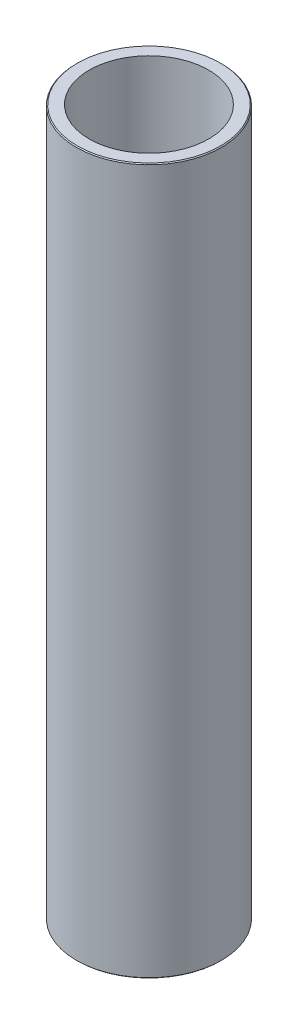
ISO-10303-21;
HEADER;
FILE_DESCRIPTION(('STEP AP214'),'2;1');
FILE_NAME('part.step','',(''),(''),'','','');
FILE_SCHEMA(('AUTOMOTIVE_DESIGN { 1 0 10303 214 1 1 1 1 }'));
ENDSEC;
DATA;
#1=APPLICATION_CONTEXT('core data for automotive mechanical design processes');
#2=APPLICATION_PROTOCOL_DEFINITION('international standard','automotive_design',2000,#1);
#3=PRODUCT_CONTEXT('',#1,'mechanical');
#4=PRODUCT('Part','Part','',(#3));
#5=PRODUCT_RELATED_PRODUCT_CATEGORY('part','',(#4));
#6=PRODUCT_DEFINITION_FORMATION('','',#4);
#7=PRODUCT_DEFINITION_CONTEXT('part definition',#1,'design');
#8=PRODUCT_DEFINITION('design','',#6,#7);
#9=PRODUCT_DEFINITION_SHAPE('','',#8);
#10=(LENGTH_UNIT() NAMED_UNIT(*) SI_UNIT(.MILLI.,.METRE.));
#11=(NAMED_UNIT(*) PLANE_ANGLE_UNIT() SI_UNIT($,.RADIAN.));
#12=(NAMED_UNIT(*) SI_UNIT($,.STERADIAN.) SOLID_ANGLE_UNIT());
#13=UNCERTAINTY_MEASURE_WITH_UNIT(LENGTH_MEASURE(1.E-05),#10,'distance_accuracy_value','');
#14=(GEOMETRIC_REPRESENTATION_CONTEXT(3) GLOBAL_UNCERTAINTY_ASSIGNED_CONTEXT((#13)) GLOBAL_UNIT_ASSIGNED_CONTEXT((#10,
#11,#12)) REPRESENTATION_CONTEXT('',''));
#15=CARTESIAN_POINT('',(0.,0.,0.));
#16=DIRECTION('',(0.,0.,1.));
#17=DIRECTION('',(1.,0.,0.));
#18=AXIS2_PLACEMENT_3D('',#15,#16,#17);
#19=CARTESIAN_POINT('',(0.,559.195337416163,0.));
#20=DIRECTION('',(0.,-1.,0.));
#21=DIRECTION('',(0.,0.,-1.));
#22=AXIS2_PLACEMENT_3D('',#19,#20,#21);
#23=CYLINDRICAL_SURFACE('',#22,57.5);
#24=CARTESIAN_POINT('',(0.,558.473531604233,0.));
#25=DIRECTION('',(0.,1.,0.));
#26=DIRECTION('',(0.,0.,1.));
#27=AXIS2_PLACEMENT_3D('',#24,#25,#26);
#28=CIRCLE('',#27,57.5);
#29=CARTESIAN_POINT('',(0.,558.473531604233,57.5));
#30=VERTEX_POINT('',#29);
#31=EDGE_CURVE('E50',#30,#30,#28,.F.);
#32=ORIENTED_EDGE('',*,*,#31,.T.);
#33=EDGE_LOOP('',(#32));
#34=FACE_BOUND('',#33,.T.);
#35=CARTESIAN_POINT('',(0.,0.721805811929932,0.));
#36=DIRECTION('',(0.,1.,0.));
#37=DIRECTION('',(0.,0.,1.));
#38=AXIS2_PLACEMENT_3D('',#35,#36,#37);
#39=CIRCLE('',#38,57.5);
#40=CARTESIAN_POINT('',(0.,0.721805811929932,57.5));
#41=VERTEX_POINT('',#40);
#42=EDGE_CURVE('E51',#41,#41,#39,.T.);
#43=ORIENTED_EDGE('',*,*,#42,.T.);
#44=EDGE_LOOP('',(#43));
#45=FACE_BOUND('',#44,.T.);
#46=ADVANCED_FACE('F39',(#34,#45),#23,.T.);
#47=CARTESIAN_POINT('',(0.,559.195337416163,0.));
#48=DIRECTION('',(0.,1.,0.));
#49=DIRECTION('',(0.,0.,1.));
#50=AXIS2_PLACEMENT_3D('',#47,#48,#49);
#51=PLANE('',#50);
#52=CARTESIAN_POINT('',(0.,559.195337416163,0.));
#53=DIRECTION('',(0.,1.,0.));
#54=DIRECTION('',(0.,0.,1.));
#55=AXIS2_PLACEMENT_3D('',#52,#53,#54);
#56=CIRCLE('',#55,56.7781941880701);
#57=CARTESIAN_POINT('',(0.,559.195337416163,56.7781941880701));
#58=VERTEX_POINT('',#57);
#59=EDGE_CURVE('E54',#58,#58,#56,.T.);
#60=ORIENTED_EDGE('',*,*,#59,.T.);
#61=EDGE_LOOP('',(#60));
#62=FACE_BOUND('',#61,.T.);
#63=CARTESIAN_POINT('',(0.,559.195337416163,0.));
#64=DIRECTION('',(0.,1.,0.));
#65=DIRECTION('',(0.,0.,1.));
#66=AXIS2_PLACEMENT_3D('',#63,#64,#65);
#67=CIRCLE('',#66,47.3325763658902);
#68=CARTESIAN_POINT('',(0.,559.195337416163,47.3325763658902));
#69=VERTEX_POINT('',#68);
#70=EDGE_CURVE('E58',#69,#69,#67,.T.);
#71=ORIENTED_EDGE('',*,*,#70,.F.);
#72=EDGE_LOOP('',(#71));
#73=FACE_BOUND('',#72,.T.);
#74=ADVANCED_FACE('F69',(#62,#73),#51,.T.);
#75=CARTESIAN_POINT('',(0.,0.,0.));
#76=DIRECTION('',(0.,1.,0.));
#77=DIRECTION('',(0.,0.,1.));
#78=AXIS2_PLACEMENT_3D('',#75,#76,#77);
#79=PLANE('',#78);
#80=CARTESIAN_POINT('',(0.,0.,0.));
#81=DIRECTION('',(0.,1.,0.));
#82=DIRECTION('',(0.,0.,1.));
#83=AXIS2_PLACEMENT_3D('',#80,#81,#82);
#84=CIRCLE('',#83,56.7781941880701);
#85=CARTESIAN_POINT('',(0.,0.,56.7781941880701));
#86=VERTEX_POINT('',#85);
#87=EDGE_CURVE('E10',#86,#86,#84,.F.);
#88=ORIENTED_EDGE('',*,*,#87,.T.);
#89=EDGE_LOOP('',(#88));
#90=FACE_BOUND('',#89,.T.);
#91=CARTESIAN_POINT('',(0.,0.,0.));
#92=DIRECTION('',(0.,1.,0.));
#93=DIRECTION('',(0.,0.,1.));
#94=AXIS2_PLACEMENT_3D('',#91,#92,#93);
#95=CIRCLE('',#94,47.3325763658902);
#96=CARTESIAN_POINT('',(0.,0.,47.3325763658902));
#97=VERTEX_POINT('',#96);
#98=EDGE_CURVE('E63',#97,#97,#95,.T.);
#99=ORIENTED_EDGE('',*,*,#98,.T.);
#100=EDGE_LOOP('',(#99));
#101=FACE_BOUND('',#100,.T.);
#102=ADVANCED_FACE('F75',(#90,#101),#79,.F.);
#103=CARTESIAN_POINT('',(0.,559.195337416163,0.));
#104=DIRECTION('',(0.,-1.,0.));
#105=DIRECTION('',(0.,0.,-1.));
#106=AXIS2_PLACEMENT_3D('',#103,#104,#105);
#107=CYLINDRICAL_SURFACE('',#106,47.3325763658902);
#108=ORIENTED_EDGE('',*,*,#70,.T.);
#109=EDGE_LOOP('',(#108));
#110=FACE_BOUND('',#109,.T.);
#111=ORIENTED_EDGE('',*,*,#98,.F.);
#112=EDGE_LOOP('',(#111));
#113=FACE_BOUND('',#112,.T.);
#114=ADVANCED_FACE('F70',(#110,#113),#107,.F.);
#115=CARTESIAN_POINT('',(0.,559.195337416163,0.));
#116=DIRECTION('',(0.,-1.,0.));
#117=DIRECTION('',(0.,0.,-1.));
#118=AXIS2_PLACEMENT_3D('',#115,#116,#117);
#119=CONICAL_SURFACE('',#118,56.7781941880701,0.785398163397496);
#120=ORIENTED_EDGE('',*,*,#31,.F.);
#121=EDGE_LOOP('',(#120));
#122=FACE_BOUND('',#121,.T.);
#123=ORIENTED_EDGE('',*,*,#59,.F.);
#124=EDGE_LOOP('',(#123));
#125=FACE_BOUND('',#124,.T.);
#126=ADVANCED_FACE('F81',(#122,#125),#119,.T.);
#127=CARTESIAN_POINT('',(0.,0.721805811929932,0.));
#128=DIRECTION('',(0.,1.,0.));
#129=DIRECTION('',(0.,0.,1.));
#130=AXIS2_PLACEMENT_3D('',#127,#128,#129);
#131=CONICAL_SURFACE('',#130,57.5,0.78539816339741);
#132=CARTESIAN_POINT('',(0.,0.,56.7781941880701));
#133=CARTESIAN_POINT('',(0.,0.0075188105409359,56.7857129986111));
#134=CARTESIAN_POINT('',(0.,0.0150376210818731,56.793231809152));
#135=CARTESIAN_POINT('',(0.,0.0300752421637475,56.8082694302339));
#136=CARTESIAN_POINT('',(0.,0.0375940527046846,56.8157882407748));
#137=CARTESIAN_POINT('',(0.,0.0526316737865578,56.8308258618567));
#138=CARTESIAN_POINT('',(0.,0.0601504843274938,56.8383446723976));
#139=CARTESIAN_POINT('',(0.,0.0751881054093671,56.8533822934795));
#140=CARTESIAN_POINT('',(0.,0.0827069159503045,56.8609011040204));
#141=CARTESIAN_POINT('',(0.,0.0977445370321783,56.8759387251023));
#142=CARTESIAN_POINT('',(0.,0.105263347573115,56.8834575356432));
#143=CARTESIAN_POINT('',(0.,0.120300968654989,56.8984951567251));
#144=CARTESIAN_POINT('',(0.,0.127819779195926,56.906013967266));
#145=CARTESIAN_POINT('',(0.,0.142857400277799,56.9210515883479));
#146=CARTESIAN_POINT('',(0.,0.150376210818735,56.9285703988889));
#147=CARTESIAN_POINT('',(0.,0.165413831900609,56.9436080199707));
#148=CARTESIAN_POINT('',(0.,0.172932642441546,56.9511268305117));
#149=CARTESIAN_POINT('',(0.,0.18797026352342,56.9661644515935));
#150=CARTESIAN_POINT('',(0.,0.195489074064356,56.9736832621345));
#151=CARTESIAN_POINT('',(0.,0.21052669514623,56.9887208832163));
#152=CARTESIAN_POINT('',(0.,0.218045505687168,56.9962396937573));
#153=CARTESIAN_POINT('',(0.,0.233083126769041,57.0112773148391));
#154=CARTESIAN_POINT('',(0.,0.240601937309977,57.0187961253801));
#155=CARTESIAN_POINT('',(0.,0.25563955839185,57.033833746462));
#156=CARTESIAN_POINT('',(0.,0.263158368932787,57.0413525570029));
#157=CARTESIAN_POINT('',(0.,0.278195990014661,57.0563901780848));
#158=CARTESIAN_POINT('',(0.,0.285714800555598,57.0639089886257));
#159=CARTESIAN_POINT('',(0.,0.300752421637472,57.0789466097076));
#160=CARTESIAN_POINT('',(0.,0.308271232178409,57.0864654202485));
#161=CARTESIAN_POINT('',(0.,0.323308853260282,57.1015030413304));
#162=CARTESIAN_POINT('',(0.,0.330827663801218,57.1090218518713));
#163=CARTESIAN_POINT('',(0.,0.345865284883092,57.1240594729532));
#164=CARTESIAN_POINT('',(0.,0.353384095424029,57.1315782834941));
#165=CARTESIAN_POINT('',(0.,0.368421716505903,57.146615904576));
#166=CARTESIAN_POINT('',(0.,0.375940527046839,57.1541347151169));
#167=CARTESIAN_POINT('',(0.,0.390978148128713,57.1691723361988));
#168=CARTESIAN_POINT('',(0.,0.398496958669651,57.1766911467397));
#169=CARTESIAN_POINT('',(0.,0.413534579751524,57.1917287678216));
#170=CARTESIAN_POINT('',(0.,0.42105339029246,57.1992475783626));
#171=CARTESIAN_POINT('',(0.,0.436091011374333,57.2142851994444));
#172=CARTESIAN_POINT('',(0.,0.44360982191527,57.2218040099854));
#173=CARTESIAN_POINT('',(0.,0.458647442997144,57.2368416310672));
#174=CARTESIAN_POINT('',(0.,0.466166253538081,57.2443604416082));
#175=CARTESIAN_POINT('',(0.,0.481203874619955,57.25939806269));
#176=CARTESIAN_POINT('',(0.,0.488722685160892,57.266916873231));
#177=CARTESIAN_POINT('',(0.,0.503760306242765,57.2819544943128));
#178=CARTESIAN_POINT('',(0.,0.511279116783701,57.2894733048538));
#179=CARTESIAN_POINT('',(0.,0.526316737865575,57.3045109259357));
#180=CARTESIAN_POINT('',(0.,0.533835548406512,57.3120297364766));
#181=CARTESIAN_POINT('',(0.,0.548873169488386,57.3270673575585));
#182=CARTESIAN_POINT('',(0.,0.556391980029322,57.3345861680994));
#183=CARTESIAN_POINT('',(0.,0.571429601111196,57.3496237891813));
#184=CARTESIAN_POINT('',(0.,0.578948411652134,57.3571425997222));
#185=CARTESIAN_POINT('',(0.,0.593986032734007,57.3721802208041));
#186=CARTESIAN_POINT('',(0.,0.601504843274943,57.379699031345));
#187=CARTESIAN_POINT('',(0.,0.616542464356816,57.3947366524269));
#188=CARTESIAN_POINT('',(0.,0.624061274897753,57.4022554629678));
#189=CARTESIAN_POINT('',(0.,0.639098895979627,57.4172930840497));
#190=CARTESIAN_POINT('',(0.,0.646617706520564,57.4248118945906));
#191=CARTESIAN_POINT('',(0.,0.661655327602438,57.4398495156725));
#192=CARTESIAN_POINT('',(0.,0.669174138143375,57.4473683262134));
#193=CARTESIAN_POINT('',(0.,0.684211759225248,57.4624059472953));
#194=CARTESIAN_POINT('',(0.,0.691730569766185,57.4699247578363));
#195=CARTESIAN_POINT('',(0.,0.706768190848057,57.4849623789181));
#196=CARTESIAN_POINT('',(0.,0.714287001388993,57.4924811894591));
#197=CARTESIAN_POINT('',(0.,0.721805811929932,57.5));
#198=B_SPLINE_CURVE_WITH_KNOTS('',3,(#132,#133,#134,#135,#136,#137,#138,#139,#140,#141,#142,
#143,#144,#145,#146,#147,#148,#149,#150,#151,#152,#153,#154,#155,#156,#157,#158,#159,#160,#161,
#162,#163,#164,#165,#166,#167,#168,#169,#170,#171,#172,#173,#174,#175,#176,#177,#178,#179,#180,
#181,#182,#183,#184,#185,#186,#187,#188,#189,#190,#191,#192,#193,#194,#195,#196,#197),
.UNSPECIFIED.,.F.,.F.,(4,2,2,2,2,2,2,2,2,2,2,2,2,2,2,2,2,2,2,2,2,2,2,2,2,2,2,2,2,2,2,2,4),(0.,
0.0318996115197173,0.0637992230394347,0.0956988345591569,0.127598446078874,0.159498057598592,
0.191397669118309,0.223297280638031,0.255196892157749,0.287096503677466,0.318996115197183,
0.350895726716905,0.382795338236623,0.41469494975634,0.446594561276058,0.47849417279578,
0.510393784315497,0.542293395835214,0.574193007354932,0.606092618874654,0.637992230394371,
0.669891841914089,0.701791453433806,0.733691064953528,0.765590676473246,0.797490287992963,
0.82938989951268,0.861289511032402,0.89318912255212,0.925088734071837,0.956988345591554,
0.988887957111276,1.02078756863099),.UNSPECIFIED.);
#199=EDGE_CURVE('BSEAM45',#86,#41,#198,.T.);
#200=ORIENTED_EDGE('',*,*,#87,.F.);
#201=ORIENTED_EDGE('',*,*,#42,.F.);
#202=ORIENTED_EDGE('',*,*,#199,.T.);
#203=ORIENTED_EDGE('',*,*,#199,.F.);
#204=EDGE_LOOP('',(#200,#202,#201,#203));
#205=FACE_BOUND('',#204,.T.);
#206=ADVANCED_FACE('F45',(#205),#131,.T.);
#207=CLOSED_SHELL('',(#46,#74,#102,#114,#126,#206));
#208=MANIFOLD_SOLID_BREP('B2',#207);
#209=ADVANCED_BREP_SHAPE_REPRESENTATION('',(#18,#208),#14);
#210=SHAPE_DEFINITION_REPRESENTATION(#9,#209);
ENDSEC;
END-ISO-10303-21;
